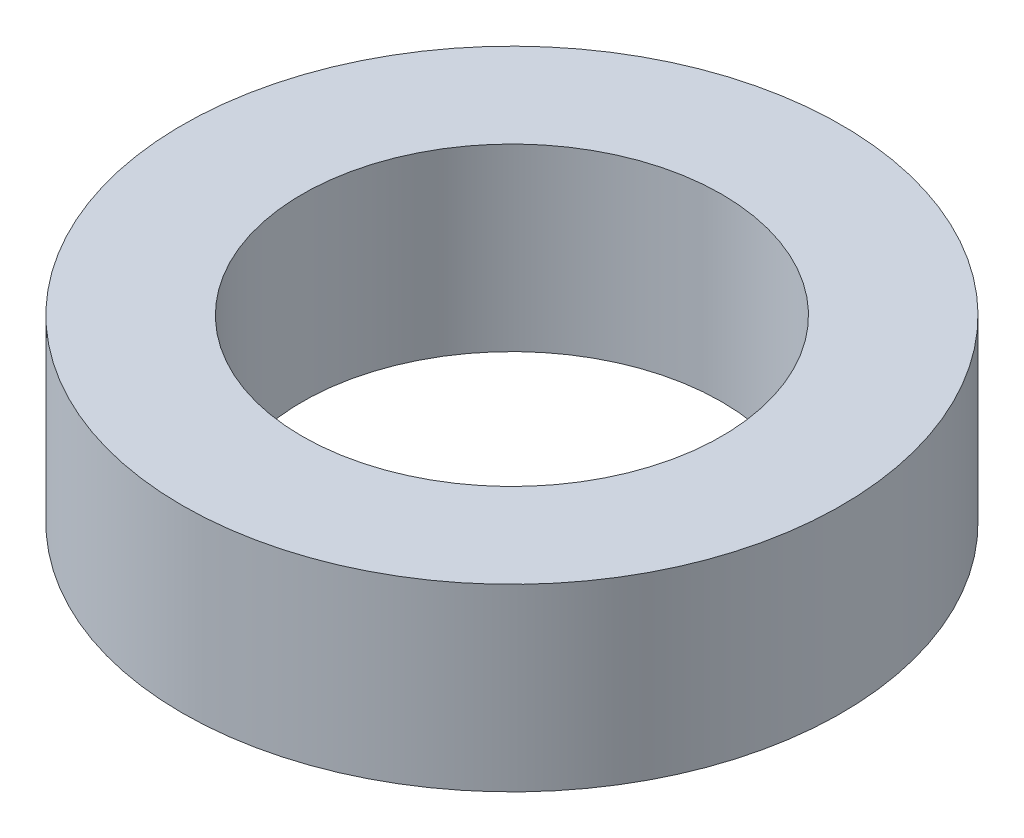
ISO-10303-21;
HEADER;
FILE_DESCRIPTION(('STEP AP214'),'2;1');
FILE_NAME('part.step','',(''),(''),'','','');
FILE_SCHEMA(('AUTOMOTIVE_DESIGN { 1 0 10303 214 1 1 1 1 }'));
ENDSEC;
DATA;
#1=APPLICATION_CONTEXT('core data for automotive mechanical design processes');
#2=APPLICATION_PROTOCOL_DEFINITION('international standard','automotive_design',2000,#1);
#3=PRODUCT_CONTEXT('',#1,'mechanical');
#4=PRODUCT('Part','Part','',(#3));
#5=PRODUCT_RELATED_PRODUCT_CATEGORY('part','',(#4));
#6=PRODUCT_DEFINITION_FORMATION('','',#4);
#7=PRODUCT_DEFINITION_CONTEXT('part definition',#1,'design');
#8=PRODUCT_DEFINITION('design','',#6,#7);
#9=PRODUCT_DEFINITION_SHAPE('','',#8);
#10=(LENGTH_UNIT() NAMED_UNIT(*) SI_UNIT(.MILLI.,.METRE.));
#11=(NAMED_UNIT(*) PLANE_ANGLE_UNIT() SI_UNIT($,.RADIAN.));
#12=(NAMED_UNIT(*) SI_UNIT($,.STERADIAN.) SOLID_ANGLE_UNIT());
#13=UNCERTAINTY_MEASURE_WITH_UNIT(LENGTH_MEASURE(1.E-05),#10,'distance_accuracy_value','');
#14=(GEOMETRIC_REPRESENTATION_CONTEXT(3) GLOBAL_UNCERTAINTY_ASSIGNED_CONTEXT((#13)) GLOBAL_UNIT_ASSIGNED_CONTEXT((#10,
#11,#12)) REPRESENTATION_CONTEXT('',''));
#15=CARTESIAN_POINT('',(0.,0.,0.));
#16=DIRECTION('',(0.,0.,1.));
#17=DIRECTION('',(1.,0.,0.));
#18=AXIS2_PLACEMENT_3D('',#15,#16,#17);
#19=CARTESIAN_POINT('',(0.,15.,0.));
#20=DIRECTION('',(0.,-1.,0.));
#21=DIRECTION('',(0.,0.,-1.));
#22=AXIS2_PLACEMENT_3D('',#19,#20,#21);
#23=CYLINDRICAL_SURFACE('',#22,27.5);
#24=CARTESIAN_POINT('',(0.,15.,0.));
#25=DIRECTION('',(0.,1.,0.));
#26=DIRECTION('',(0.,0.,1.));
#27=AXIS2_PLACEMENT_3D('',#24,#25,#26);
#28=CIRCLE('',#27,27.5);
#29=CARTESIAN_POINT('',(0.,15.,27.5));
#30=VERTEX_POINT('',#29);
#31=EDGE_CURVE('E10',#30,#30,#28,.T.);
#32=ORIENTED_EDGE('',*,*,#31,.F.);
#33=EDGE_LOOP('',(#32));
#34=FACE_BOUND('',#33,.T.);
#35=CARTESIAN_POINT('',(0.,0.,0.));
#36=DIRECTION('',(0.,1.,0.));
#37=DIRECTION('',(0.,0.,1.));
#38=AXIS2_PLACEMENT_3D('',#35,#36,#37);
#39=CIRCLE('',#38,27.5);
#40=CARTESIAN_POINT('',(0.,0.,27.5));
#41=VERTEX_POINT('',#40);
#42=EDGE_CURVE('E37',#41,#41,#39,.T.);
#43=ORIENTED_EDGE('',*,*,#42,.T.);
#44=EDGE_LOOP('',(#43));
#45=FACE_BOUND('',#44,.T.);
#46=ADVANCED_FACE('F40',(#34,#45),#23,.T.);
#47=CARTESIAN_POINT('',(0.,15.,0.));
#48=DIRECTION('',(0.,1.,0.));
#49=DIRECTION('',(0.,0.,1.));
#50=AXIS2_PLACEMENT_3D('',#47,#48,#49);
#51=PLANE('',#50);
#52=CARTESIAN_POINT('',(0.,15.,0.));
#53=DIRECTION('',(0.,1.,0.));
#54=DIRECTION('',(0.,0.,1.));
#55=AXIS2_PLACEMENT_3D('',#52,#53,#54);
#56=CIRCLE('',#55,17.5);
#57=CARTESIAN_POINT('',(0.,15.,17.5));
#58=VERTEX_POINT('',#57);
#59=EDGE_CURVE('E50',#58,#58,#56,.T.);
#60=ORIENTED_EDGE('',*,*,#59,.F.);
#61=EDGE_LOOP('',(#60));
#62=FACE_BOUND('',#61,.T.);
#63=ORIENTED_EDGE('',*,*,#31,.T.);
#64=EDGE_LOOP('',(#63));
#65=FACE_BOUND('',#64,.T.);
#66=ADVANCED_FACE('F59',(#62,#65),#51,.T.);
#67=CARTESIAN_POINT('',(0.,0.,0.));
#68=DIRECTION('',(0.,1.,0.));
#69=DIRECTION('',(0.,0.,1.));
#70=AXIS2_PLACEMENT_3D('',#67,#68,#69);
#71=PLANE('',#70);
#72=CARTESIAN_POINT('',(0.,0.,0.));
#73=DIRECTION('',(0.,1.,0.));
#74=DIRECTION('',(0.,0.,1.));
#75=AXIS2_PLACEMENT_3D('',#72,#73,#74);
#76=CIRCLE('',#75,17.5);
#77=CARTESIAN_POINT('',(0.,0.,17.5));
#78=VERTEX_POINT('',#77);
#79=EDGE_CURVE('E47',#78,#78,#76,.T.);
#80=ORIENTED_EDGE('',*,*,#79,.T.);
#81=EDGE_LOOP('',(#80));
#82=FACE_BOUND('',#81,.T.);
#83=ORIENTED_EDGE('',*,*,#42,.F.);
#84=EDGE_LOOP('',(#83));
#85=FACE_BOUND('',#84,.T.);
#86=ADVANCED_FACE('F58',(#82,#85),#71,.F.);
#87=CARTESIAN_POINT('',(0.,15.,0.));
#88=DIRECTION('',(0.,-1.,0.));
#89=DIRECTION('',(0.,0.,-1.));
#90=AXIS2_PLACEMENT_3D('',#87,#88,#89);
#91=CYLINDRICAL_SURFACE('',#90,17.5);
#92=ORIENTED_EDGE('',*,*,#59,.T.);
#93=EDGE_LOOP('',(#92));
#94=FACE_BOUND('',#93,.T.);
#95=ORIENTED_EDGE('',*,*,#79,.F.);
#96=EDGE_LOOP('',(#95));
#97=FACE_BOUND('',#96,.T.);
#98=ADVANCED_FACE('F54',(#94,#97),#91,.F.);
#99=CLOSED_SHELL('',(#46,#66,#86,#98));
#100=MANIFOLD_SOLID_BREP('B2',#99);
#101=ADVANCED_BREP_SHAPE_REPRESENTATION('',(#18,#100),#14);
#102=SHAPE_DEFINITION_REPRESENTATION(#9,#101);
ENDSEC;
END-ISO-10303-21;
